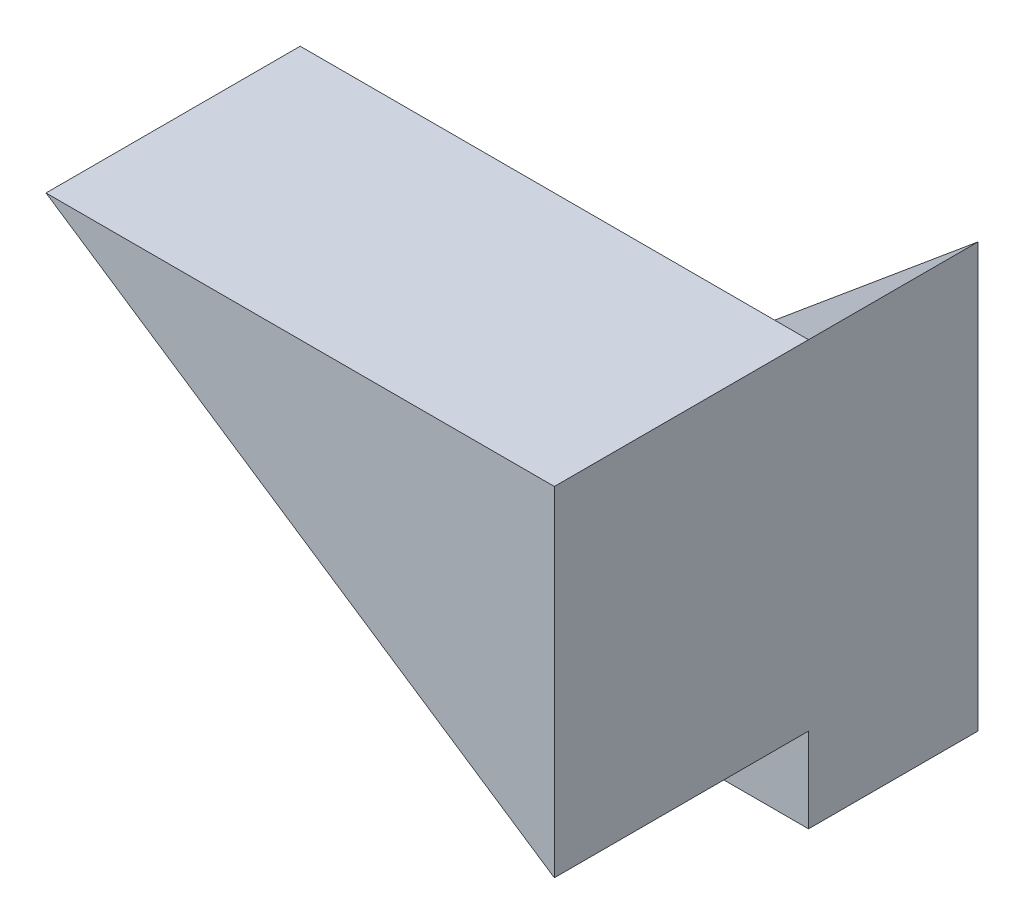
ISO-10303-21;
HEADER;
FILE_DESCRIPTION(('STEP AP214'),'2;1');
FILE_NAME('part.step','',(''),(''),'','','');
FILE_SCHEMA(('AUTOMOTIVE_DESIGN { 1 0 10303 214 1 1 1 1 }'));
ENDSEC;
DATA;
#1=APPLICATION_CONTEXT('core data for automotive mechanical design processes');
#2=APPLICATION_PROTOCOL_DEFINITION('international standard','automotive_design',2000,#1);
#3=PRODUCT_CONTEXT('',#1,'mechanical');
#4=PRODUCT('Part','Part','',(#3));
#5=PRODUCT_RELATED_PRODUCT_CATEGORY('part','',(#4));
#6=PRODUCT_DEFINITION_FORMATION('','',#4);
#7=PRODUCT_DEFINITION_CONTEXT('part definition',#1,'design');
#8=PRODUCT_DEFINITION('design','',#6,#7);
#9=PRODUCT_DEFINITION_SHAPE('','',#8);
#10=(LENGTH_UNIT() NAMED_UNIT(*) SI_UNIT(.MILLI.,.METRE.));
#11=(NAMED_UNIT(*) PLANE_ANGLE_UNIT() SI_UNIT($,.RADIAN.));
#12=(NAMED_UNIT(*) SI_UNIT($,.STERADIAN.) SOLID_ANGLE_UNIT());
#13=UNCERTAINTY_MEASURE_WITH_UNIT(LENGTH_MEASURE(1.E-05),#10,'distance_accuracy_value','');
#14=(GEOMETRIC_REPRESENTATION_CONTEXT(3) GLOBAL_UNCERTAINTY_ASSIGNED_CONTEXT((#13)) GLOBAL_UNIT_ASSIGNED_CONTEXT((#10,
#11,#12)) REPRESENTATION_CONTEXT('',''));
#15=CARTESIAN_POINT('',(0.,0.,0.));
#16=DIRECTION('',(0.,0.,1.));
#17=DIRECTION('',(1.,0.,0.));
#18=AXIS2_PLACEMENT_3D('',#15,#16,#17);
#19=CARTESIAN_POINT('',(0.,0.,10.));
#20=DIRECTION('',(-1.,0.,0.));
#21=DIRECTION('',(0.,0.,1.));
#22=AXIS2_PLACEMENT_3D('',#19,#20,#21);
#23=PLANE('',#22);
#24=DIRECTION('',(0.,1.,0.));
#25=VECTOR('',#24,1.);
#26=CARTESIAN_POINT('',(0.,0.,0.));
#27=LINE('',#26,#25);
#28=CARTESIAN_POINT('',(0.,0.,0.));
#29=VERTEX_POINT('',#28);
#30=CARTESIAN_POINT('',(0.,25.,0.));
#31=VERTEX_POINT('',#30);
#32=EDGE_CURVE('E118',#29,#31,#27,.T.);
#33=ORIENTED_EDGE('',*,*,#32,.T.);
#34=DIRECTION('',(0.,0.,-1.));
#35=VECTOR('',#34,1.);
#36=CARTESIAN_POINT('',(0.,25.,10.));
#37=LINE('',#36,#35);
#38=CARTESIAN_POINT('',(0.,25.,10.));
#39=VERTEX_POINT('',#38);
#40=EDGE_CURVE('E43',#39,#31,#37,.T.);
#41=ORIENTED_EDGE('',*,*,#40,.F.);
#42=DIRECTION('',(0.,0.,-1.));
#43=VECTOR('',#42,1.);
#44=CARTESIAN_POINT('',(0.,25.,25.));
#45=LINE('',#44,#43);
#46=CARTESIAN_POINT('',(0.,25.,25.));
#47=VERTEX_POINT('',#46);
#48=EDGE_CURVE('E103',#47,#39,#45,.T.);
#49=ORIENTED_EDGE('',*,*,#48,.F.);
#50=DIRECTION('',(0.,1.,0.));
#51=VECTOR('',#50,1.);
#52=CARTESIAN_POINT('',(0.,25.,25.));
#53=LINE('',#52,#51);
#54=CARTESIAN_POINT('',(0.,5.,25.));
#55=VERTEX_POINT('',#54);
#56=EDGE_CURVE('E96',#55,#47,#53,.T.);
#57=ORIENTED_EDGE('',*,*,#56,.F.);
#58=DIRECTION('',(0.,0.,-1.));
#59=VECTOR('',#58,1.);
#60=CARTESIAN_POINT('',(0.,5.,25.));
#61=LINE('',#60,#59);
#62=CARTESIAN_POINT('',(0.,5.,10.));
#63=VERTEX_POINT('',#62);
#64=EDGE_CURVE('E101',#55,#63,#61,.T.);
#65=ORIENTED_EDGE('',*,*,#64,.T.);
#66=DIRECTION('',(0.,1.,0.));
#67=VECTOR('',#66,1.);
#68=CARTESIAN_POINT('',(0.,0.,10.));
#69=LINE('',#68,#67);
#70=CARTESIAN_POINT('',(0.,0.,10.));
#71=VERTEX_POINT('',#70);
#72=EDGE_CURVE('E125',#71,#63,#69,.T.);
#73=ORIENTED_EDGE('',*,*,#72,.F.);
#74=DIRECTION('',(0.,0.,-1.));
#75=VECTOR('',#74,1.);
#76=CARTESIAN_POINT('',(0.,0.,10.));
#77=LINE('',#76,#75);
#78=EDGE_CURVE('E137',#71,#29,#77,.T.);
#79=ORIENTED_EDGE('',*,*,#78,.T.);
#80=EDGE_LOOP('',(#33,#41,#49,#57,#65,#73,#79));
#81=FACE_BOUND('',#80,.T.);
#82=ADVANCED_FACE('F35',(#81),#23,.F.);
#83=CARTESIAN_POINT('',(-12.2950819672131,14.7540983606557,10.));
#84=DIRECTION('',(0.64018439966448,-0.768221279597376,0.));
#85=DIRECTION('',(0.768221279597376,0.64018439966448,0.));
#86=AXIS2_PLACEMENT_3D('',#83,#84,#85);
#87=PLANE('',#86);
#88=DIRECTION('',(-0.768221279597376,-0.64018439966448,0.));
#89=VECTOR('',#88,1.);
#90=CARTESIAN_POINT('',(-12.2950819672131,14.7540983606557,0.));
#91=LINE('',#90,#89);
#92=CARTESIAN_POINT('',(-30.,0.,0.));
#93=VERTEX_POINT('',#92);
#94=EDGE_CURVE('E119',#31,#93,#91,.T.);
#95=ORIENTED_EDGE('',*,*,#94,.T.);
#96=DIRECTION('',(0.,0.,-1.));
#97=VECTOR('',#96,1.);
#98=CARTESIAN_POINT('',(-30.,0.,10.));
#99=LINE('',#98,#97);
#100=CARTESIAN_POINT('',(-30.,0.,10.));
#101=VERTEX_POINT('',#100);
#102=EDGE_CURVE('E142',#101,#93,#99,.T.);
#103=ORIENTED_EDGE('',*,*,#102,.F.);
#104=DIRECTION('',(-0.768221279597376,-0.64018439966448,0.));
#105=VECTOR('',#104,1.);
#106=CARTESIAN_POINT('',(-12.2950819672131,14.7540983606557,10.));
#107=LINE('',#106,#105);
#108=CARTESIAN_POINT('',(-13.3333333333333,13.8888888888889,10.));
#109=VERTEX_POINT('',#108);
#110=EDGE_CURVE('E136',#109,#101,#107,.T.);
#111=ORIENTED_EDGE('',*,*,#110,.F.);
#112=EDGE_CURVE('E78',#39,#109,#107,.T.);
#113=ORIENTED_EDGE('',*,*,#112,.F.);
#114=ORIENTED_EDGE('',*,*,#40,.T.);
#115=EDGE_LOOP('',(#95,#103,#111,#113,#114));
#116=FACE_BOUND('',#115,.T.);
#117=ADVANCED_FACE('F143',(#116),#87,.F.);
#118=CARTESIAN_POINT('',(0.,0.,10.));
#119=DIRECTION('',(0.,1.,0.));
#120=DIRECTION('',(0.,0.,1.));
#121=AXIS2_PLACEMENT_3D('',#118,#119,#120);
#122=PLANE('',#121);
#123=DIRECTION('',(1.,0.,0.));
#124=VECTOR('',#123,1.);
#125=CARTESIAN_POINT('',(0.,0.,0.));
#126=LINE('',#125,#124);
#127=EDGE_CURVE('E72',#93,#29,#126,.T.);
#128=ORIENTED_EDGE('',*,*,#127,.T.);
#129=ORIENTED_EDGE('',*,*,#78,.F.);
#130=DIRECTION('',(1.,0.,0.));
#131=VECTOR('',#130,1.);
#132=CARTESIAN_POINT('',(0.,0.,10.));
#133=LINE('',#132,#131);
#134=EDGE_CURVE('E55',#101,#71,#133,.T.);
#135=ORIENTED_EDGE('',*,*,#134,.F.);
#136=ORIENTED_EDGE('',*,*,#102,.T.);
#137=EDGE_LOOP('',(#128,#129,#135,#136));
#138=FACE_BOUND('',#137,.T.);
#139=ADVANCED_FACE('F158',(#138),#122,.F.);
#140=CARTESIAN_POINT('',(0.,0.,10.));
#141=DIRECTION('',(0.,0.,1.));
#142=DIRECTION('',(1.,0.,0.));
#143=AXIS2_PLACEMENT_3D('',#140,#141,#142);
#144=PLANE('',#143);
#145=DIRECTION('',(0.832050294337844,-0.554700196225229,0.));
#146=VECTOR('',#145,1.);
#147=CARTESIAN_POINT('',(0.,5.,10.));
#148=LINE('',#147,#146);
#149=EDGE_CURVE('E11',#109,#63,#148,.T.);
#150=ORIENTED_EDGE('',*,*,#149,.F.);
#151=ORIENTED_EDGE('',*,*,#110,.T.);
#152=ORIENTED_EDGE('',*,*,#134,.T.);
#153=ORIENTED_EDGE('',*,*,#72,.T.);
#154=EDGE_LOOP('',(#150,#151,#152,#153));
#155=FACE_BOUND('',#154,.T.);
#156=ADVANCED_FACE('F150',(#155),#144,.T.);
#157=CARTESIAN_POINT('',(0.,0.,0.));
#158=DIRECTION('',(0.,0.,1.));
#159=DIRECTION('',(1.,0.,0.));
#160=AXIS2_PLACEMENT_3D('',#157,#158,#159);
#161=PLANE('',#160);
#162=ORIENTED_EDGE('',*,*,#32,.F.);
#163=ORIENTED_EDGE('',*,*,#127,.F.);
#164=ORIENTED_EDGE('',*,*,#94,.F.);
#165=EDGE_LOOP('',(#162,#163,#164));
#166=FACE_BOUND('',#165,.T.);
#167=ADVANCED_FACE('F147',(#166),#161,.F.);
#168=CARTESIAN_POINT('',(0.,0.,10.));
#169=DIRECTION('',(0.,0.,1.));
#170=DIRECTION('',(1.,0.,0.));
#171=AXIS2_PLACEMENT_3D('',#168,#169,#170);
#172=PLANE('',#171);
#173=DIRECTION('',(-1.,0.,0.));
#174=VECTOR('',#173,1.);
#175=CARTESIAN_POINT('',(-30.,25.,10.));
#176=LINE('',#175,#174);
#177=CARTESIAN_POINT('',(-30.,25.,10.));
#178=VERTEX_POINT('',#177);
#179=EDGE_CURVE('E114',#39,#178,#176,.T.);
#180=ORIENTED_EDGE('',*,*,#179,.F.);
#181=ORIENTED_EDGE('',*,*,#112,.T.);
#182=EDGE_CURVE('E128',#178,#109,#148,.T.);
#183=ORIENTED_EDGE('',*,*,#182,.F.);
#184=EDGE_LOOP('',(#180,#181,#183));
#185=FACE_BOUND('',#184,.T.);
#186=ADVANCED_FACE('F149',(#185),#172,.F.);
#187=CARTESIAN_POINT('',(0.,5.,25.));
#188=DIRECTION('',(0.554700196225229,0.832050294337844,0.));
#189=DIRECTION('',(-0.832050294337844,0.554700196225229,0.));
#190=AXIS2_PLACEMENT_3D('',#187,#188,#189);
#191=PLANE('',#190);
#192=ORIENTED_EDGE('',*,*,#182,.T.);
#193=ORIENTED_EDGE('',*,*,#149,.T.);
#194=ORIENTED_EDGE('',*,*,#64,.F.);
#195=DIRECTION('',(0.832050294337844,-0.554700196225229,0.));
#196=VECTOR('',#195,1.);
#197=CARTESIAN_POINT('',(0.,5.,25.));
#198=LINE('',#197,#196);
#199=CARTESIAN_POINT('',(-30.,25.,25.));
#200=VERTEX_POINT('',#199);
#201=EDGE_CURVE('E107',#200,#55,#198,.T.);
#202=ORIENTED_EDGE('',*,*,#201,.F.);
#203=DIRECTION('',(0.,0.,-1.));
#204=VECTOR('',#203,1.);
#205=CARTESIAN_POINT('',(-30.,25.,25.));
#206=LINE('',#205,#204);
#207=EDGE_CURVE('E121',#200,#178,#206,.T.);
#208=ORIENTED_EDGE('',*,*,#207,.T.);
#209=EDGE_LOOP('',(#192,#193,#194,#202,#208));
#210=FACE_BOUND('',#209,.T.);
#211=ADVANCED_FACE('F117',(#210),#191,.F.);
#212=CARTESIAN_POINT('',(-30.,25.,25.));
#213=DIRECTION('',(0.,-1.,0.));
#214=DIRECTION('',(0.,0.,-1.));
#215=AXIS2_PLACEMENT_3D('',#212,#213,#214);
#216=PLANE('',#215);
#217=ORIENTED_EDGE('',*,*,#179,.T.);
#218=ORIENTED_EDGE('',*,*,#207,.F.);
#219=DIRECTION('',(-1.,0.,0.));
#220=VECTOR('',#219,1.);
#221=CARTESIAN_POINT('',(-30.,25.,25.));
#222=LINE('',#221,#220);
#223=EDGE_CURVE('E106',#47,#200,#222,.T.);
#224=ORIENTED_EDGE('',*,*,#223,.F.);
#225=ORIENTED_EDGE('',*,*,#48,.T.);
#226=EDGE_LOOP('',(#217,#218,#224,#225));
#227=FACE_BOUND('',#226,.T.);
#228=ADVANCED_FACE('F193',(#227),#216,.F.);
#229=CARTESIAN_POINT('',(0.,0.,25.));
#230=DIRECTION('',(0.,0.,1.));
#231=DIRECTION('',(1.,0.,0.));
#232=AXIS2_PLACEMENT_3D('',#229,#230,#231);
#233=PLANE('',#232);
#234=ORIENTED_EDGE('',*,*,#201,.T.);
#235=ORIENTED_EDGE('',*,*,#56,.T.);
#236=ORIENTED_EDGE('',*,*,#223,.T.);
#237=EDGE_LOOP('',(#234,#235,#236));
#238=FACE_BOUND('',#237,.T.);
#239=ADVANCED_FACE('F110',(#238),#233,.T.);
#240=CLOSED_SHELL('',(#82,#117,#139,#156,#167,#186,#211,#228,#239));
#241=MANIFOLD_SOLID_BREP('B2',#240);
#242=ADVANCED_BREP_SHAPE_REPRESENTATION('',(#18,#241),#14);
#243=SHAPE_DEFINITION_REPRESENTATION(#9,#242);
ENDSEC;
END-ISO-10303-21;
